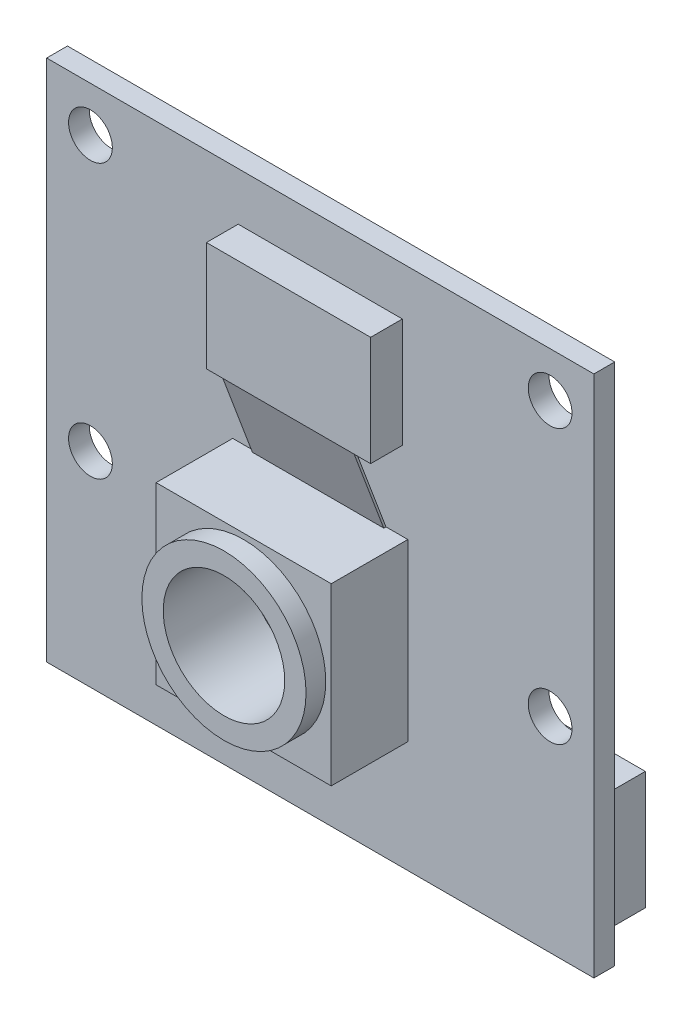
ISO-10303-21;
HEADER;
FILE_DESCRIPTION(('STEP AP214'),'2;1');
FILE_NAME('part.step','',(''),(''),'','','');
FILE_SCHEMA(('AUTOMOTIVE_DESIGN { 1 0 10303 214 1 1 1 1 }'));
ENDSEC;
DATA;
#1=APPLICATION_CONTEXT('core data for automotive mechanical design processes');
#2=APPLICATION_PROTOCOL_DEFINITION('international standard','automotive_design',2000,#1);
#3=PRODUCT_CONTEXT('',#1,'mechanical');
#4=PRODUCT('Part','Part','',(#3));
#5=PRODUCT_RELATED_PRODUCT_CATEGORY('part','',(#4));
#6=PRODUCT_DEFINITION_FORMATION('','',#4);
#7=PRODUCT_DEFINITION_CONTEXT('part definition',#1,'design');
#8=PRODUCT_DEFINITION('design','',#6,#7);
#9=PRODUCT_DEFINITION_SHAPE('','',#8);
#10=(LENGTH_UNIT() NAMED_UNIT(*) SI_UNIT(.MILLI.,.METRE.));
#11=(NAMED_UNIT(*) PLANE_ANGLE_UNIT() SI_UNIT($,.RADIAN.));
#12=(NAMED_UNIT(*) SI_UNIT($,.STERADIAN.) SOLID_ANGLE_UNIT());
#13=UNCERTAINTY_MEASURE_WITH_UNIT(LENGTH_MEASURE(1.E-05),#10,'distance_accuracy_value','');
#14=(GEOMETRIC_REPRESENTATION_CONTEXT(3) GLOBAL_UNCERTAINTY_ASSIGNED_CONTEXT((#13)) GLOBAL_UNIT_ASSIGNED_CONTEXT((#10,
#11,#12)) REPRESENTATION_CONTEXT('',''));
#15=CARTESIAN_POINT('',(0.,0.,0.));
#16=DIRECTION('',(0.,0.,1.));
#17=DIRECTION('',(1.,0.,0.));
#18=AXIS2_PLACEMENT_3D('',#15,#16,#17);
#19=CARTESIAN_POINT('',(0.,0.,0.));
#20=DIRECTION('',(0.,0.,1.));
#21=DIRECTION('',(1.,0.,0.));
#22=AXIS2_PLACEMENT_3D('',#19,#20,#21);
#23=PLANE('',#22);
#24=DIRECTION('',(1.,0.,0.));
#25=VECTOR('',#24,1.);
#26=CARTESIAN_POINT('',(0.,0.,0.));
#27=LINE('',#26,#25);
#28=CARTESIAN_POINT('',(0.,0.,0.));
#29=VERTEX_POINT('',#28);
#30=CARTESIAN_POINT('',(25.,0.,0.));
#31=VERTEX_POINT('',#30);
#32=EDGE_CURVE('E347',#29,#31,#27,.T.);
#33=ORIENTED_EDGE('',*,*,#32,.F.);
#34=DIRECTION('',(0.,1.,0.));
#35=VECTOR('',#34,1.);
#36=CARTESIAN_POINT('',(0.,0.,0.));
#37=LINE('',#36,#35);
#38=CARTESIAN_POINT('',(0.,23.9,0.));
#39=VERTEX_POINT('',#38);
#40=EDGE_CURVE('E315',#29,#39,#37,.T.);
#41=ORIENTED_EDGE('',*,*,#40,.T.);
#42=DIRECTION('',(1.,0.,0.));
#43=VECTOR('',#42,1.);
#44=CARTESIAN_POINT('',(0.,23.9,0.));
#45=LINE('',#44,#43);
#46=CARTESIAN_POINT('',(25.,23.9,0.));
#47=VERTEX_POINT('',#46);
#48=EDGE_CURVE('E353',#39,#47,#45,.T.);
#49=ORIENTED_EDGE('',*,*,#48,.T.);
#50=DIRECTION('',(0.,1.,0.));
#51=VECTOR('',#50,1.);
#52=CARTESIAN_POINT('',(25.,0.,0.));
#53=LINE('',#52,#51);
#54=EDGE_CURVE('E350',#31,#47,#53,.T.);
#55=ORIENTED_EDGE('',*,*,#54,.F.);
#56=EDGE_LOOP('',(#33,#41,#49,#55));
#57=FACE_BOUND('',#56,.T.);
#58=CARTESIAN_POINT('',(2.,21.85,0.));
#59=DIRECTION('',(0.,0.,1.));
#60=DIRECTION('',(1.,0.,0.));
#61=AXIS2_PLACEMENT_3D('',#58,#59,#60);
#62=CIRCLE('',#61,1.);
#63=CARTESIAN_POINT('',(3.,21.85,0.));
#64=VERTEX_POINT('',#63);
#65=EDGE_CURVE('E344',#64,#64,#62,.T.);
#66=ORIENTED_EDGE('',*,*,#65,.T.);
#67=EDGE_LOOP('',(#66));
#68=FACE_BOUND('',#67,.T.);
#69=CARTESIAN_POINT('',(23.,21.85,0.));
#70=DIRECTION('',(0.,0.,1.));
#71=DIRECTION('',(1.,0.,0.));
#72=AXIS2_PLACEMENT_3D('',#69,#70,#71);
#73=CIRCLE('',#72,1.);
#74=CARTESIAN_POINT('',(24.,21.85,0.));
#75=VERTEX_POINT('',#74);
#76=EDGE_CURVE('E341',#75,#75,#73,.T.);
#77=ORIENTED_EDGE('',*,*,#76,.T.);
#78=EDGE_LOOP('',(#77));
#79=FACE_BOUND('',#78,.T.);
#80=CARTESIAN_POINT('',(2.,9.35,0.));
#81=DIRECTION('',(0.,0.,1.));
#82=DIRECTION('',(1.,0.,0.));
#83=AXIS2_PLACEMENT_3D('',#80,#81,#82);
#84=CIRCLE('',#83,1.);
#85=CARTESIAN_POINT('',(3.,9.35,0.));
#86=VERTEX_POINT('',#85);
#87=EDGE_CURVE('E338',#86,#86,#84,.T.);
#88=ORIENTED_EDGE('',*,*,#87,.T.);
#89=EDGE_LOOP('',(#88));
#90=FACE_BOUND('',#89,.T.);
#91=CARTESIAN_POINT('',(23.,9.35,0.));
#92=DIRECTION('',(0.,0.,1.));
#93=DIRECTION('',(1.,0.,0.));
#94=AXIS2_PLACEMENT_3D('',#91,#92,#93);
#95=CIRCLE('',#94,1.);
#96=CARTESIAN_POINT('',(24.,9.35,0.));
#97=VERTEX_POINT('',#96);
#98=EDGE_CURVE('E310',#97,#97,#95,.T.);
#99=ORIENTED_EDGE('',*,*,#98,.T.);
#100=EDGE_LOOP('',(#99));
#101=FACE_BOUND('',#100,.T.);
#102=DIRECTION('',(0.,-1.,0.));
#103=VECTOR('',#102,1.);
#104=CARTESIAN_POINT('',(23.6,0.,0.));
#105=LINE('',#104,#103);
#106=CARTESIAN_POINT('',(23.6,5.59999999999999,0.));
#107=VERTEX_POINT('',#106);
#108=CARTESIAN_POINT('',(23.6,0.2,0.));
#109=VERTEX_POINT('',#108);
#110=EDGE_CURVE('E198',#107,#109,#105,.T.);
#111=ORIENTED_EDGE('',*,*,#110,.F.);
#112=DIRECTION('',(1.,0.,0.));
#113=VECTOR('',#112,1.);
#114=CARTESIAN_POINT('',(0.,5.6,0.));
#115=LINE('',#114,#113);
#116=CARTESIAN_POINT('',(1.4,5.6,0.));
#117=VERTEX_POINT('',#116);
#118=EDGE_CURVE('E195',#117,#107,#115,.T.);
#119=ORIENTED_EDGE('',*,*,#118,.F.);
#120=DIRECTION('',(0.,-1.,0.));
#121=VECTOR('',#120,1.);
#122=CARTESIAN_POINT('',(1.4,0.,0.));
#123=LINE('',#122,#121);
#124=CARTESIAN_POINT('',(1.4,0.2,0.));
#125=VERTEX_POINT('',#124);
#126=EDGE_CURVE('E60',#117,#125,#123,.T.);
#127=ORIENTED_EDGE('',*,*,#126,.T.);
#128=DIRECTION('',(-1.,0.,0.));
#129=VECTOR('',#128,1.);
#130=CARTESIAN_POINT('',(0.,0.2,0.));
#131=LINE('',#130,#129);
#132=EDGE_CURVE('E55',#109,#125,#131,.T.);
#133=ORIENTED_EDGE('',*,*,#132,.F.);
#134=EDGE_LOOP('',(#111,#119,#127,#133));
#135=FACE_BOUND('',#134,.T.);
#136=ADVANCED_FACE('F40',(#57,#68,#79,#90,#101,#135),#23,.F.);
#137=CARTESIAN_POINT('',(8.50000000000001,13.1,5.35));
#138=DIRECTION('',(1.,0.,0.));
#139=DIRECTION('',(0.,1.,0.));
#140=AXIS2_PLACEMENT_3D('',#137,#138,#139);
#141=PLANE('',#140);
#142=DIRECTION('',(0.,-1.,0.));
#143=VECTOR('',#142,1.);
#144=CARTESIAN_POINT('',(8.50000000000001,0.,4.45));
#145=LINE('',#144,#143);
#146=CARTESIAN_POINT('',(8.50000000000001,13.1,4.45));
#147=VERTEX_POINT('',#146);
#148=CARTESIAN_POINT('',(8.50000000000001,5.1,4.45));
#149=VERTEX_POINT('',#148);
#150=EDGE_CURVE('E249',#147,#149,#145,.T.);
#151=ORIENTED_EDGE('',*,*,#150,.F.);
#152=DIRECTION('',(0.,0.,-1.));
#153=VECTOR('',#152,1.);
#154=CARTESIAN_POINT('',(8.50000000000001,13.1,5.35));
#155=LINE('',#154,#153);
#156=CARTESIAN_POINT('',(8.50000000000001,13.1,0.95));
#157=VERTEX_POINT('',#156);
#158=EDGE_CURVE('E270',#147,#157,#155,.T.);
#159=ORIENTED_EDGE('',*,*,#158,.T.);
#160=DIRECTION('',(0.,-1.,0.));
#161=VECTOR('',#160,1.);
#162=CARTESIAN_POINT('',(8.50000000000001,13.1,0.95));
#163=LINE('',#162,#161);
#164=CARTESIAN_POINT('',(8.50000000000001,5.1,0.95));
#165=VERTEX_POINT('',#164);
#166=EDGE_CURVE('E255',#157,#165,#163,.T.);
#167=ORIENTED_EDGE('',*,*,#166,.T.);
#168=DIRECTION('',(0.,0.,-1.));
#169=VECTOR('',#168,1.);
#170=CARTESIAN_POINT('',(8.50000000000001,5.1,5.35));
#171=LINE('',#170,#169);
#172=EDGE_CURVE('E277',#149,#165,#171,.T.);
#173=ORIENTED_EDGE('',*,*,#172,.F.);
#174=EDGE_LOOP('',(#151,#159,#167,#173));
#175=FACE_BOUND('',#174,.T.);
#176=ADVANCED_FACE('F393',(#175),#141,.F.);
#177=CARTESIAN_POINT('',(8.50000000000001,5.1,5.35));
#178=DIRECTION('',(0.,1.,0.));
#179=DIRECTION('',(-1.,0.,0.));
#180=AXIS2_PLACEMENT_3D('',#177,#178,#179);
#181=PLANE('',#180);
#182=DIRECTION('',(1.,0.,0.));
#183=VECTOR('',#182,1.);
#184=CARTESIAN_POINT('',(0.,5.1,4.45));
#185=LINE('',#184,#183);
#186=CARTESIAN_POINT('',(16.5,5.1,4.45));
#187=VERTEX_POINT('',#186);
#188=EDGE_CURVE('E251',#149,#187,#185,.T.);
#189=ORIENTED_EDGE('',*,*,#188,.F.);
#190=ORIENTED_EDGE('',*,*,#172,.T.);
#191=DIRECTION('',(1.,0.,0.));
#192=VECTOR('',#191,1.);
#193=CARTESIAN_POINT('',(8.50000000000001,5.1,0.95));
#194=LINE('',#193,#192);
#195=CARTESIAN_POINT('',(16.5,5.1,0.95));
#196=VERTEX_POINT('',#195);
#197=EDGE_CURVE('E260',#165,#196,#194,.T.);
#198=ORIENTED_EDGE('',*,*,#197,.T.);
#199=DIRECTION('',(0.,0.,-1.));
#200=VECTOR('',#199,1.);
#201=CARTESIAN_POINT('',(16.5,5.1,5.35));
#202=LINE('',#201,#200);
#203=EDGE_CURVE('E275',#187,#196,#202,.T.);
#204=ORIENTED_EDGE('',*,*,#203,.F.);
#205=EDGE_LOOP('',(#189,#190,#198,#204));
#206=FACE_BOUND('',#205,.T.);
#207=ADVANCED_FACE('F398',(#206),#181,.F.);
#208=CARTESIAN_POINT('',(16.5,13.1,5.35));
#209=DIRECTION('',(-1.,0.,0.));
#210=DIRECTION('',(0.,-1.,0.));
#211=AXIS2_PLACEMENT_3D('',#208,#209,#210);
#212=PLANE('',#211);
#213=DIRECTION('',(0.,1.,0.));
#214=VECTOR('',#213,1.);
#215=CARTESIAN_POINT('',(16.5,0.,4.45));
#216=LINE('',#215,#214);
#217=CARTESIAN_POINT('',(16.5,13.1,4.45));
#218=VERTEX_POINT('',#217);
#219=EDGE_CURVE('E253',#187,#218,#216,.T.);
#220=ORIENTED_EDGE('',*,*,#219,.F.);
#221=ORIENTED_EDGE('',*,*,#203,.T.);
#222=DIRECTION('',(0.,1.,0.));
#223=VECTOR('',#222,1.);
#224=CARTESIAN_POINT('',(16.5,13.1,0.95));
#225=LINE('',#224,#223);
#226=CARTESIAN_POINT('',(16.5,13.1,0.95));
#227=VERTEX_POINT('',#226);
#228=EDGE_CURVE('E263',#196,#227,#225,.T.);
#229=ORIENTED_EDGE('',*,*,#228,.T.);
#230=DIRECTION('',(0.,0.,-1.));
#231=VECTOR('',#230,1.);
#232=CARTESIAN_POINT('',(16.5,13.1,5.35));
#233=LINE('',#232,#231);
#234=EDGE_CURVE('E273',#218,#227,#233,.T.);
#235=ORIENTED_EDGE('',*,*,#234,.F.);
#236=EDGE_LOOP('',(#220,#221,#229,#235));
#237=FACE_BOUND('',#236,.T.);
#238=ADVANCED_FACE('F497',(#237),#212,.F.);
#239=CARTESIAN_POINT('',(8.50000000000001,13.1,5.35));
#240=DIRECTION('',(0.,-1.,0.));
#241=DIRECTION('',(0.,0.,-1.));
#242=AXIS2_PLACEMENT_3D('',#239,#240,#241);
#243=PLANE('',#242);
#244=DIRECTION('',(1.,0.,0.));
#245=VECTOR('',#244,1.);
#246=CARTESIAN_POINT('',(5.61895632593499,13.1,1.05));
#247=LINE('',#246,#245);
#248=CARTESIAN_POINT('',(9.5,13.1,1.05));
#249=VERTEX_POINT('',#248);
#250=CARTESIAN_POINT('',(15.5,13.1,1.05));
#251=VERTEX_POINT('',#250);
#252=EDGE_CURVE('E222',#249,#251,#247,.T.);
#253=ORIENTED_EDGE('',*,*,#252,.F.);
#254=DIRECTION('',(0.,0.,-1.));
#255=VECTOR('',#254,1.);
#256=CARTESIAN_POINT('',(9.5,13.1,0.95));
#257=LINE('',#256,#255);
#258=CARTESIAN_POINT('',(9.5,13.1,0.95));
#259=VERTEX_POINT('',#258);
#260=EDGE_CURVE('E210',#249,#259,#257,.T.);
#261=ORIENTED_EDGE('',*,*,#260,.T.);
#262=DIRECTION('',(-1.,0.,0.));
#263=VECTOR('',#262,1.);
#264=CARTESIAN_POINT('',(8.50000000000001,13.1,0.95));
#265=LINE('',#264,#263);
#266=EDGE_CURVE('E266',#259,#157,#265,.T.);
#267=ORIENTED_EDGE('',*,*,#266,.T.);
#268=ORIENTED_EDGE('',*,*,#158,.F.);
#269=DIRECTION('',(-1.,0.,0.));
#270=VECTOR('',#269,1.);
#271=CARTESIAN_POINT('',(0.,13.1,4.45));
#272=LINE('',#271,#270);
#273=EDGE_CURVE('E247',#218,#147,#272,.T.);
#274=ORIENTED_EDGE('',*,*,#273,.F.);
#275=ORIENTED_EDGE('',*,*,#234,.T.);
#276=CARTESIAN_POINT('',(15.5,13.1,0.95));
#277=VERTEX_POINT('',#276);
#278=EDGE_CURVE('E267',#227,#277,#265,.T.);
#279=ORIENTED_EDGE('',*,*,#278,.T.);
#280=DIRECTION('',(0.,0.,-1.));
#281=VECTOR('',#280,1.);
#282=CARTESIAN_POINT('',(15.5,13.1,0.95));
#283=LINE('',#282,#281);
#284=EDGE_CURVE('E202',#251,#277,#283,.T.);
#285=ORIENTED_EDGE('',*,*,#284,.F.);
#286=EDGE_LOOP('',(#253,#261,#267,#268,#274,#275,#279,#285));
#287=FACE_BOUND('',#286,.T.);
#288=ADVANCED_FACE('F388',(#287),#243,.F.);
#289=CARTESIAN_POINT('',(0.,0.,0.95));
#290=DIRECTION('',(0.,0.,1.));
#291=DIRECTION('',(1.,0.,0.));
#292=AXIS2_PLACEMENT_3D('',#289,#290,#291);
#293=PLANE('',#292);
#294=DIRECTION('',(1.,0.,0.));
#295=VECTOR('',#294,1.);
#296=CARTESIAN_POINT('',(8.75,16.7,0.95));
#297=LINE('',#296,#295);
#298=CARTESIAN_POINT('',(8.75,16.7,0.95));
#299=VERTEX_POINT('',#298);
#300=CARTESIAN_POINT('',(16.25,16.7,0.95));
#301=VERTEX_POINT('',#300);
#302=EDGE_CURVE('E295',#299,#301,#297,.T.);
#303=ORIENTED_EDGE('',*,*,#302,.F.);
#304=DIRECTION('',(0.,-1.,0.));
#305=VECTOR('',#304,1.);
#306=CARTESIAN_POINT('',(8.75,21.7,0.95));
#307=LINE('',#306,#305);
#308=CARTESIAN_POINT('',(8.75,21.7,0.95));
#309=VERTEX_POINT('',#308);
#310=EDGE_CURVE('E279',#309,#299,#307,.T.);
#311=ORIENTED_EDGE('',*,*,#310,.F.);
#312=DIRECTION('',(-1.,0.,0.));
#313=VECTOR('',#312,1.);
#314=CARTESIAN_POINT('',(8.75,21.7,0.95));
#315=LINE('',#314,#313);
#316=CARTESIAN_POINT('',(16.25,21.7,0.95));
#317=VERTEX_POINT('',#316);
#318=EDGE_CURVE('E284',#317,#309,#315,.T.);
#319=ORIENTED_EDGE('',*,*,#318,.F.);
#320=DIRECTION('',(0.,1.,0.));
#321=VECTOR('',#320,1.);
#322=CARTESIAN_POINT('',(16.25,21.7,0.95));
#323=LINE('',#322,#321);
#324=EDGE_CURVE('E297',#301,#317,#323,.T.);
#325=ORIENTED_EDGE('',*,*,#324,.F.);
#326=EDGE_LOOP('',(#303,#311,#319,#325));
#327=FACE_BOUND('',#326,.T.);
#328=CARTESIAN_POINT('',(23.,9.35,0.95));
#329=DIRECTION('',(0.,0.,1.));
#330=DIRECTION('',(1.,0.,0.));
#331=AXIS2_PLACEMENT_3D('',#328,#329,#330);
#332=CIRCLE('',#331,1.);
#333=CARTESIAN_POINT('',(24.,9.35,0.95));
#334=VERTEX_POINT('',#333);
#335=EDGE_CURVE('E311',#334,#334,#332,.T.);
#336=ORIENTED_EDGE('',*,*,#335,.F.);
#337=EDGE_LOOP('',(#336));
#338=FACE_BOUND('',#337,.T.);
#339=CARTESIAN_POINT('',(2.,9.35,0.95));
#340=DIRECTION('',(0.,0.,1.));
#341=DIRECTION('',(1.,0.,0.));
#342=AXIS2_PLACEMENT_3D('',#339,#340,#341);
#343=CIRCLE('',#342,1.);
#344=CARTESIAN_POINT('',(3.,9.35,0.95));
#345=VERTEX_POINT('',#344);
#346=EDGE_CURVE('E314',#345,#345,#343,.T.);
#347=ORIENTED_EDGE('',*,*,#346,.F.);
#348=EDGE_LOOP('',(#347));
#349=FACE_BOUND('',#348,.T.);
#350=CARTESIAN_POINT('',(23.,21.85,0.95));
#351=DIRECTION('',(0.,0.,1.));
#352=DIRECTION('',(1.,0.,0.));
#353=AXIS2_PLACEMENT_3D('',#350,#351,#352);
#354=CIRCLE('',#353,1.);
#355=CARTESIAN_POINT('',(24.,21.85,0.95));
#356=VERTEX_POINT('',#355);
#357=EDGE_CURVE('E318',#356,#356,#354,.T.);
#358=ORIENTED_EDGE('',*,*,#357,.F.);
#359=EDGE_LOOP('',(#358));
#360=FACE_BOUND('',#359,.T.);
#361=CARTESIAN_POINT('',(2.,21.85,0.95));
#362=DIRECTION('',(0.,0.,1.));
#363=DIRECTION('',(1.,0.,0.));
#364=AXIS2_PLACEMENT_3D('',#361,#362,#363);
#365=CIRCLE('',#364,1.);
#366=CARTESIAN_POINT('',(3.,21.85,0.95));
#367=VERTEX_POINT('',#366);
#368=EDGE_CURVE('E321',#367,#367,#365,.T.);
#369=ORIENTED_EDGE('',*,*,#368,.F.);
#370=EDGE_LOOP('',(#369));
#371=FACE_BOUND('',#370,.T.);
#372=DIRECTION('',(1.,0.,0.));
#373=VECTOR('',#372,1.);
#374=CARTESIAN_POINT('',(0.,0.,0.95));
#375=LINE('',#374,#373);
#376=CARTESIAN_POINT('',(0.,0.,0.95));
#377=VERTEX_POINT('',#376);
#378=CARTESIAN_POINT('',(25.,0.,0.95));
#379=VERTEX_POINT('',#378);
#380=EDGE_CURVE('E324',#377,#379,#375,.T.);
#381=ORIENTED_EDGE('',*,*,#380,.T.);
#382=DIRECTION('',(0.,1.,0.));
#383=VECTOR('',#382,1.);
#384=CARTESIAN_POINT('',(25.,0.,0.95));
#385=LINE('',#384,#383);
#386=CARTESIAN_POINT('',(25.,23.9,0.95));
#387=VERTEX_POINT('',#386);
#388=EDGE_CURVE('E327',#379,#387,#385,.T.);
#389=ORIENTED_EDGE('',*,*,#388,.T.);
#390=DIRECTION('',(1.,0.,0.));
#391=VECTOR('',#390,1.);
#392=CARTESIAN_POINT('',(0.,23.9,0.95));
#393=LINE('',#392,#391);
#394=CARTESIAN_POINT('',(0.,23.9,0.95));
#395=VERTEX_POINT('',#394);
#396=EDGE_CURVE('E329',#395,#387,#393,.T.);
#397=ORIENTED_EDGE('',*,*,#396,.F.);
#398=DIRECTION('',(0.,1.,0.));
#399=VECTOR('',#398,1.);
#400=CARTESIAN_POINT('',(0.,0.,0.95));
#401=LINE('',#400,#399);
#402=EDGE_CURVE('E332',#377,#395,#401,.T.);
#403=ORIENTED_EDGE('',*,*,#402,.F.);
#404=EDGE_LOOP('',(#381,#389,#397,#403));
#405=FACE_BOUND('',#404,.T.);
#406=ORIENTED_EDGE('',*,*,#197,.F.);
#407=ORIENTED_EDGE('',*,*,#166,.F.);
#408=ORIENTED_EDGE('',*,*,#266,.F.);
#409=DIRECTION('',(1.,0.,0.));
#410=VECTOR('',#409,1.);
#411=CARTESIAN_POINT('',(5.61895632593499,13.1,0.95));
#412=LINE('',#411,#410);
#413=EDGE_CURVE('E218',#259,#277,#412,.T.);
#414=ORIENTED_EDGE('',*,*,#413,.T.);
#415=ORIENTED_EDGE('',*,*,#278,.F.);
#416=ORIENTED_EDGE('',*,*,#228,.F.);
#417=EDGE_LOOP('',(#406,#407,#408,#414,#415,#416));
#418=FACE_BOUND('',#417,.T.);
#419=ADVANCED_FACE('F377',(#327,#338,#349,#360,#371,#405,#418),#293,.T.);
#420=CARTESIAN_POINT('',(0.,0.,0.95));
#421=DIRECTION('',(0.,1.,0.));
#422=DIRECTION('',(0.,0.,1.));
#423=AXIS2_PLACEMENT_3D('',#420,#421,#422);
#424=PLANE('',#423);
#425=ORIENTED_EDGE('',*,*,#32,.T.);
#426=DIRECTION('',(0.,0.,-1.));
#427=VECTOR('',#426,1.);
#428=CARTESIAN_POINT('',(25.,0.,0.95));
#429=LINE('',#428,#427);
#430=EDGE_CURVE('E11',#379,#31,#429,.T.);
#431=ORIENTED_EDGE('',*,*,#430,.F.);
#432=ORIENTED_EDGE('',*,*,#380,.F.);
#433=DIRECTION('',(0.,0.,-1.));
#434=VECTOR('',#433,1.);
#435=CARTESIAN_POINT('',(0.,0.,0.95));
#436=LINE('',#435,#434);
#437=EDGE_CURVE('E335',#377,#29,#436,.T.);
#438=ORIENTED_EDGE('',*,*,#437,.T.);
#439=EDGE_LOOP('',(#425,#431,#432,#438));
#440=FACE_BOUND('',#439,.T.);
#441=ADVANCED_FACE('F380',(#440),#424,.F.);
#442=CARTESIAN_POINT('',(25.,0.,0.95));
#443=DIRECTION('',(-1.,0.,0.));
#444=DIRECTION('',(0.,-1.,0.));
#445=AXIS2_PLACEMENT_3D('',#442,#443,#444);
#446=PLANE('',#445);
#447=ORIENTED_EDGE('',*,*,#54,.T.);
#448=DIRECTION('',(0.,0.,-1.));
#449=VECTOR('',#448,1.);
#450=CARTESIAN_POINT('',(25.,23.9,0.95));
#451=LINE('',#450,#449);
#452=EDGE_CURVE('E48',#387,#47,#451,.T.);
#453=ORIENTED_EDGE('',*,*,#452,.F.);
#454=ORIENTED_EDGE('',*,*,#388,.F.);
#455=ORIENTED_EDGE('',*,*,#430,.T.);
#456=EDGE_LOOP('',(#447,#453,#454,#455));
#457=FACE_BOUND('',#456,.T.);
#458=ADVANCED_FACE('F366',(#457),#446,.F.);
#459=CARTESIAN_POINT('',(0.,23.9,0.95));
#460=DIRECTION('',(0.,1.,0.));
#461=DIRECTION('',(0.,0.,1.));
#462=AXIS2_PLACEMENT_3D('',#459,#460,#461);
#463=PLANE('',#462);
#464=ORIENTED_EDGE('',*,*,#48,.F.);
#465=DIRECTION('',(0.,0.,-1.));
#466=VECTOR('',#465,1.);
#467=CARTESIAN_POINT('',(0.,23.9,0.95));
#468=LINE('',#467,#466);
#469=EDGE_CURVE('E359',#395,#39,#468,.T.);
#470=ORIENTED_EDGE('',*,*,#469,.F.);
#471=ORIENTED_EDGE('',*,*,#396,.T.);
#472=ORIENTED_EDGE('',*,*,#452,.T.);
#473=EDGE_LOOP('',(#464,#470,#471,#472));
#474=FACE_BOUND('',#473,.T.);
#475=ADVANCED_FACE('F363',(#474),#463,.T.);
#476=CARTESIAN_POINT('',(2.,21.85,0.95));
#477=DIRECTION('',(0.,0.,-1.));
#478=DIRECTION('',(-1.,0.,0.));
#479=AXIS2_PLACEMENT_3D('',#476,#477,#478);
#480=CYLINDRICAL_SURFACE('',#479,1.);
#481=ORIENTED_EDGE('',*,*,#368,.T.);
#482=EDGE_LOOP('',(#481));
#483=FACE_BOUND('',#482,.T.);
#484=ORIENTED_EDGE('',*,*,#65,.F.);
#485=EDGE_LOOP('',(#484));
#486=FACE_BOUND('',#485,.T.);
#487=ADVANCED_FACE('F407',(#483,#486),#480,.F.);
#488=CARTESIAN_POINT('',(23.,21.85,0.95));
#489=DIRECTION('',(0.,0.,-1.));
#490=DIRECTION('',(-1.,0.,0.));
#491=AXIS2_PLACEMENT_3D('',#488,#489,#490);
#492=CYLINDRICAL_SURFACE('',#491,1.);
#493=ORIENTED_EDGE('',*,*,#357,.T.);
#494=EDGE_LOOP('',(#493));
#495=FACE_BOUND('',#494,.T.);
#496=ORIENTED_EDGE('',*,*,#76,.F.);
#497=EDGE_LOOP('',(#496));
#498=FACE_BOUND('',#497,.T.);
#499=ADVANCED_FACE('F411',(#495,#498),#492,.F.);
#500=CARTESIAN_POINT('',(2.,9.35,0.95));
#501=DIRECTION('',(0.,0.,-1.));
#502=DIRECTION('',(-1.,0.,0.));
#503=AXIS2_PLACEMENT_3D('',#500,#501,#502);
#504=CYLINDRICAL_SURFACE('',#503,1.);
#505=ORIENTED_EDGE('',*,*,#346,.T.);
#506=EDGE_LOOP('',(#505));
#507=FACE_BOUND('',#506,.T.);
#508=ORIENTED_EDGE('',*,*,#87,.F.);
#509=EDGE_LOOP('',(#508));
#510=FACE_BOUND('',#509,.T.);
#511=ADVANCED_FACE('F416',(#507,#510),#504,.F.);
#512=CARTESIAN_POINT('',(23.,9.35,0.95));
#513=DIRECTION('',(0.,0.,-1.));
#514=DIRECTION('',(-1.,0.,0.));
#515=AXIS2_PLACEMENT_3D('',#512,#513,#514);
#516=CYLINDRICAL_SURFACE('',#515,1.);
#517=ORIENTED_EDGE('',*,*,#335,.T.);
#518=EDGE_LOOP('',(#517));
#519=FACE_BOUND('',#518,.T.);
#520=ORIENTED_EDGE('',*,*,#98,.F.);
#521=EDGE_LOOP('',(#520));
#522=FACE_BOUND('',#521,.T.);
#523=ADVANCED_FACE('F42',(#519,#522),#516,.F.);
#524=CARTESIAN_POINT('',(0.,0.,0.95));
#525=DIRECTION('',(-1.,0.,0.));
#526=DIRECTION('',(0.,-1.,0.));
#527=AXIS2_PLACEMENT_3D('',#524,#525,#526);
#528=PLANE('',#527);
#529=ORIENTED_EDGE('',*,*,#40,.F.);
#530=ORIENTED_EDGE('',*,*,#437,.F.);
#531=ORIENTED_EDGE('',*,*,#402,.T.);
#532=ORIENTED_EDGE('',*,*,#469,.T.);
#533=EDGE_LOOP('',(#529,#530,#531,#532));
#534=FACE_BOUND('',#533,.T.);
#535=ADVANCED_FACE('F373',(#534),#528,.T.);
#536=CARTESIAN_POINT('',(8.75,21.7,2.4));
#537=DIRECTION('',(1.,0.,0.));
#538=DIRECTION('',(0.,0.,-1.));
#539=AXIS2_PLACEMENT_3D('',#536,#537,#538);
#540=PLANE('',#539);
#541=ORIENTED_EDGE('',*,*,#310,.T.);
#542=DIRECTION('',(0.,0.,-1.));
#543=VECTOR('',#542,1.);
#544=CARTESIAN_POINT('',(8.75,16.7,2.4));
#545=LINE('',#544,#543);
#546=CARTESIAN_POINT('',(8.75,16.7,2.4));
#547=VERTEX_POINT('',#546);
#548=EDGE_CURVE('E308',#547,#299,#545,.T.);
#549=ORIENTED_EDGE('',*,*,#548,.F.);
#550=DIRECTION('',(0.,-1.,0.));
#551=VECTOR('',#550,1.);
#552=CARTESIAN_POINT('',(8.75,21.7,2.4));
#553=LINE('',#552,#551);
#554=CARTESIAN_POINT('',(8.75,21.7,2.4));
#555=VERTEX_POINT('',#554);
#556=EDGE_CURVE('E280',#555,#547,#553,.T.);
#557=ORIENTED_EDGE('',*,*,#556,.F.);
#558=DIRECTION('',(0.,0.,-1.));
#559=VECTOR('',#558,1.);
#560=CARTESIAN_POINT('',(8.75,21.7,2.4));
#561=LINE('',#560,#559);
#562=EDGE_CURVE('E292',#555,#309,#561,.T.);
#563=ORIENTED_EDGE('',*,*,#562,.T.);
#564=EDGE_LOOP('',(#541,#549,#557,#563));
#565=FACE_BOUND('',#564,.T.);
#566=ADVANCED_FACE('F405',(#565),#540,.F.);
#567=CARTESIAN_POINT('',(8.75,16.7,2.4));
#568=DIRECTION('',(0.,1.,0.));
#569=DIRECTION('',(0.,0.,1.));
#570=AXIS2_PLACEMENT_3D('',#567,#568,#569);
#571=PLANE('',#570);
#572=DIRECTION('',(1.,0.,0.));
#573=VECTOR('',#572,1.);
#574=CARTESIAN_POINT('',(5.61895632593499,16.7,2.3));
#575=LINE('',#574,#573);
#576=CARTESIAN_POINT('',(9.5,16.7,2.3));
#577=VERTEX_POINT('',#576);
#578=CARTESIAN_POINT('',(15.5,16.7,2.3));
#579=VERTEX_POINT('',#578);
#580=EDGE_CURVE('E227',#577,#579,#575,.T.);
#581=ORIENTED_EDGE('',*,*,#580,.F.);
#582=DIRECTION('',(0.,0.,1.));
#583=VECTOR('',#582,1.);
#584=CARTESIAN_POINT('',(9.5,16.7,2.4));
#585=LINE('',#584,#583);
#586=CARTESIAN_POINT('',(9.5,16.7,2.4));
#587=VERTEX_POINT('',#586);
#588=EDGE_CURVE('E224',#577,#587,#585,.T.);
#589=ORIENTED_EDGE('',*,*,#588,.T.);
#590=DIRECTION('',(1.,0.,0.));
#591=VECTOR('',#590,1.);
#592=CARTESIAN_POINT('',(8.75,16.7,2.4));
#593=LINE('',#592,#591);
#594=EDGE_CURVE('E285',#547,#587,#593,.T.);
#595=ORIENTED_EDGE('',*,*,#594,.F.);
#596=ORIENTED_EDGE('',*,*,#548,.T.);
#597=ORIENTED_EDGE('',*,*,#302,.T.);
#598=DIRECTION('',(0.,0.,-1.));
#599=VECTOR('',#598,1.);
#600=CARTESIAN_POINT('',(16.25,16.7,2.4));
#601=LINE('',#600,#599);
#602=CARTESIAN_POINT('',(16.25,16.7,2.4));
#603=VERTEX_POINT('',#602);
#604=EDGE_CURVE('E305',#603,#301,#601,.T.);
#605=ORIENTED_EDGE('',*,*,#604,.F.);
#606=CARTESIAN_POINT('',(15.5,16.7,2.4));
#607=VERTEX_POINT('',#606);
#608=EDGE_CURVE('E283',#607,#603,#593,.T.);
#609=ORIENTED_EDGE('',*,*,#608,.F.);
#610=DIRECTION('',(0.,0.,1.));
#611=VECTOR('',#610,1.);
#612=CARTESIAN_POINT('',(15.5,16.7,2.4));
#613=LINE('',#612,#611);
#614=EDGE_CURVE('E208',#579,#607,#613,.T.);
#615=ORIENTED_EDGE('',*,*,#614,.F.);
#616=EDGE_LOOP('',(#581,#589,#595,#596,#597,#605,#609,#615));
#617=FACE_BOUND('',#616,.T.);
#618=ADVANCED_FACE('F515',(#617),#571,.F.);
#619=CARTESIAN_POINT('',(16.25,21.7,2.4));
#620=DIRECTION('',(-1.,0.,0.));
#621=DIRECTION('',(0.,-1.,0.));
#622=AXIS2_PLACEMENT_3D('',#619,#620,#621);
#623=PLANE('',#622);
#624=ORIENTED_EDGE('',*,*,#324,.T.);
#625=DIRECTION('',(0.,0.,-1.));
#626=VECTOR('',#625,1.);
#627=CARTESIAN_POINT('',(16.25,21.7,2.4));
#628=LINE('',#627,#626);
#629=CARTESIAN_POINT('',(16.25,21.7,2.4));
#630=VERTEX_POINT('',#629);
#631=EDGE_CURVE('E303',#630,#317,#628,.T.);
#632=ORIENTED_EDGE('',*,*,#631,.F.);
#633=DIRECTION('',(0.,1.,0.));
#634=VECTOR('',#633,1.);
#635=CARTESIAN_POINT('',(16.25,21.7,2.4));
#636=LINE('',#635,#634);
#637=EDGE_CURVE('E288',#603,#630,#636,.T.);
#638=ORIENTED_EDGE('',*,*,#637,.F.);
#639=ORIENTED_EDGE('',*,*,#604,.T.);
#640=EDGE_LOOP('',(#624,#632,#638,#639));
#641=FACE_BOUND('',#640,.T.);
#642=ADVANCED_FACE('F511',(#641),#623,.F.);
#643=CARTESIAN_POINT('',(8.75,21.7,2.4));
#644=DIRECTION('',(0.,-1.,0.));
#645=DIRECTION('',(1.,0.,0.));
#646=AXIS2_PLACEMENT_3D('',#643,#644,#645);
#647=PLANE('',#646);
#648=ORIENTED_EDGE('',*,*,#318,.T.);
#649=ORIENTED_EDGE('',*,*,#562,.F.);
#650=DIRECTION('',(-1.,0.,0.));
#651=VECTOR('',#650,1.);
#652=CARTESIAN_POINT('',(8.75,21.7,2.4));
#653=LINE('',#652,#651);
#654=EDGE_CURVE('E290',#630,#555,#653,.T.);
#655=ORIENTED_EDGE('',*,*,#654,.F.);
#656=ORIENTED_EDGE('',*,*,#631,.T.);
#657=EDGE_LOOP('',(#648,#649,#655,#656));
#658=FACE_BOUND('',#657,.T.);
#659=ADVANCED_FACE('F507',(#658),#647,.F.);
#660=CARTESIAN_POINT('',(0.,0.,2.4));
#661=DIRECTION('',(0.,0.,1.));
#662=DIRECTION('',(1.,0.,0.));
#663=AXIS2_PLACEMENT_3D('',#660,#661,#662);
#664=PLANE('',#663);
#665=ORIENTED_EDGE('',*,*,#556,.T.);
#666=ORIENTED_EDGE('',*,*,#594,.T.);
#667=DIRECTION('',(1.,0.,0.));
#668=VECTOR('',#667,1.);
#669=CARTESIAN_POINT('',(5.61895632593499,16.7,2.4));
#670=LINE('',#669,#668);
#671=EDGE_CURVE('E223',#587,#607,#670,.T.);
#672=ORIENTED_EDGE('',*,*,#671,.T.);
#673=ORIENTED_EDGE('',*,*,#608,.T.);
#674=ORIENTED_EDGE('',*,*,#637,.T.);
#675=ORIENTED_EDGE('',*,*,#654,.T.);
#676=EDGE_LOOP('',(#665,#666,#672,#673,#674,#675));
#677=FACE_BOUND('',#676,.T.);
#678=ADVANCED_FACE('F490',(#677),#664,.T.);
#679=CARTESIAN_POINT('',(12.5,9.1,4.45));
#680=DIRECTION('',(0.,0.,1.));
#681=DIRECTION('',(1.,0.,0.));
#682=AXIS2_PLACEMENT_3D('',#679,#680,#681);
#683=CYLINDRICAL_SURFACE('',#682,3.75);
#684=CARTESIAN_POINT('',(12.5,9.1,4.45));
#685=DIRECTION('',(0.,0.,1.));
#686=DIRECTION('',(1.,0.,0.));
#687=AXIS2_PLACEMENT_3D('',#684,#685,#686);
#688=CIRCLE('',#687,3.75);
#689=CARTESIAN_POINT('',(16.25,9.1,4.45));
#690=VERTEX_POINT('',#689);
#691=EDGE_CURVE('E244',#690,#690,#688,.T.);
#692=ORIENTED_EDGE('',*,*,#691,.T.);
#693=EDGE_LOOP('',(#692));
#694=FACE_BOUND('',#693,.T.);
#695=CARTESIAN_POINT('',(12.5,9.1,5.35));
#696=DIRECTION('',(0.,0.,1.));
#697=DIRECTION('',(1.,0.,0.));
#698=AXIS2_PLACEMENT_3D('',#695,#696,#697);
#699=CIRCLE('',#698,3.75);
#700=CARTESIAN_POINT('',(16.25,9.1,5.35));
#701=VERTEX_POINT('',#700);
#702=EDGE_CURVE('E241',#701,#701,#699,.T.);
#703=ORIENTED_EDGE('',*,*,#702,.F.);
#704=EDGE_LOOP('',(#703));
#705=FACE_BOUND('',#704,.T.);
#706=ADVANCED_FACE('F486',(#694,#705),#683,.T.);
#707=CARTESIAN_POINT('',(0.,0.,4.45));
#708=DIRECTION('',(0.,0.,1.));
#709=DIRECTION('',(1.,0.,0.));
#710=AXIS2_PLACEMENT_3D('',#707,#708,#709);
#711=PLANE('',#710);
#712=ORIENTED_EDGE('',*,*,#691,.F.);
#713=EDGE_LOOP('',(#712));
#714=FACE_BOUND('',#713,.T.);
#715=ORIENTED_EDGE('',*,*,#273,.T.);
#716=ORIENTED_EDGE('',*,*,#150,.T.);
#717=ORIENTED_EDGE('',*,*,#188,.T.);
#718=ORIENTED_EDGE('',*,*,#219,.T.);
#719=EDGE_LOOP('',(#715,#716,#717,#718));
#720=FACE_BOUND('',#719,.T.);
#721=ADVANCED_FACE('F483',(#714,#720),#711,.T.);
#722=CARTESIAN_POINT('',(0.,0.,5.35));
#723=DIRECTION('',(0.,0.,1.));
#724=DIRECTION('',(1.,0.,0.));
#725=AXIS2_PLACEMENT_3D('',#722,#723,#724);
#726=PLANE('',#725);
#727=CARTESIAN_POINT('',(12.5,9.1,5.35));
#728=DIRECTION('',(0.,0.,1.));
#729=DIRECTION('',(1.,0.,0.));
#730=AXIS2_PLACEMENT_3D('',#727,#728,#729);
#731=CIRCLE('',#730,2.775);
#732=CARTESIAN_POINT('',(15.275,9.1,5.35));
#733=VERTEX_POINT('',#732);
#734=EDGE_CURVE('E237',#733,#733,#731,.T.);
#735=ORIENTED_EDGE('',*,*,#734,.F.);
#736=EDGE_LOOP('',(#735));
#737=FACE_BOUND('',#736,.T.);
#738=ORIENTED_EDGE('',*,*,#702,.T.);
#739=EDGE_LOOP('',(#738));
#740=FACE_BOUND('',#739,.T.);
#741=ADVANCED_FACE('F481',(#737,#740),#726,.T.);
#742=CARTESIAN_POINT('',(12.5,9.1,1.45));
#743=DIRECTION('',(0.,0.,1.));
#744=DIRECTION('',(1.,0.,0.));
#745=AXIS2_PLACEMENT_3D('',#742,#743,#744);
#746=CYLINDRICAL_SURFACE('',#745,2.775);
#747=CARTESIAN_POINT('',(12.5,9.1,1.45));
#748=DIRECTION('',(0.,0.,1.));
#749=DIRECTION('',(1.,0.,0.));
#750=AXIS2_PLACEMENT_3D('',#747,#748,#749);
#751=CIRCLE('',#750,2.775);
#752=CARTESIAN_POINT('',(15.275,9.1,1.45));
#753=VERTEX_POINT('',#752);
#754=EDGE_CURVE('E238',#753,#753,#751,.T.);
#755=ORIENTED_EDGE('',*,*,#754,.F.);
#756=EDGE_LOOP('',(#755));
#757=FACE_BOUND('',#756,.T.);
#758=ORIENTED_EDGE('',*,*,#734,.T.);
#759=EDGE_LOOP('',(#758));
#760=FACE_BOUND('',#759,.T.);
#761=ADVANCED_FACE('F477',(#757,#760),#746,.F.);
#762=CARTESIAN_POINT('',(12.5,9.1,1.45));
#763=DIRECTION('',(0.,0.,1.));
#764=DIRECTION('',(1.,0.,0.));
#765=AXIS2_PLACEMENT_3D('',#762,#763,#764);
#766=PLANE('',#765);
#767=ORIENTED_EDGE('',*,*,#754,.T.);
#768=EDGE_LOOP('',(#767));
#769=FACE_BOUND('',#768,.T.);
#770=ADVANCED_FACE('F473',(#769),#766,.T.);
#771=CARTESIAN_POINT('',(9.5,0.,0.));
#772=DIRECTION('',(-1.,0.,0.));
#773=DIRECTION('',(0.,0.,1.));
#774=AXIS2_PLACEMENT_3D('',#771,#772,#773);
#775=PLANE('',#774);
#776=DIRECTION('',(0.,-0.936329177569045,-0.351123441588392));
#777=VECTOR('',#776,1.);
#778=CARTESIAN_POINT('',(9.5,16.7,2.4));
#779=LINE('',#778,#777);
#780=EDGE_CURVE('E219',#587,#249,#779,.T.);
#781=ORIENTED_EDGE('',*,*,#780,.F.);
#782=ORIENTED_EDGE('',*,*,#588,.F.);
#783=DIRECTION('',(0.,0.936329177569045,0.351123441588392));
#784=VECTOR('',#783,1.);
#785=CARTESIAN_POINT('',(9.5,16.7,2.3));
#786=LINE('',#785,#784);
#787=EDGE_CURVE('E228',#259,#577,#786,.T.);
#788=ORIENTED_EDGE('',*,*,#787,.F.);
#789=ORIENTED_EDGE('',*,*,#260,.F.);
#790=EDGE_LOOP('',(#781,#782,#788,#789));
#791=FACE_BOUND('',#790,.T.);
#792=ADVANCED_FACE('F463',(#791),#775,.T.);
#793=CARTESIAN_POINT('',(15.5,0.,0.));
#794=DIRECTION('',(-1.,0.,0.));
#795=DIRECTION('',(0.,-1.,0.));
#796=AXIS2_PLACEMENT_3D('',#793,#794,#795);
#797=PLANE('',#796);
#798=DIRECTION('',(0.,-0.936329177569044,-0.351123441588392));
#799=VECTOR('',#798,1.);
#800=CARTESIAN_POINT('',(15.5,16.7,2.4));
#801=LINE('',#800,#799);
#802=EDGE_CURVE('E199',#607,#251,#801,.T.);
#803=ORIENTED_EDGE('',*,*,#802,.T.);
#804=ORIENTED_EDGE('',*,*,#284,.T.);
#805=DIRECTION('',(0.,0.936329177569045,0.351123441588392));
#806=VECTOR('',#805,1.);
#807=CARTESIAN_POINT('',(15.5,16.7,2.3));
#808=LINE('',#807,#806);
#809=EDGE_CURVE('E211',#277,#579,#808,.T.);
#810=ORIENTED_EDGE('',*,*,#809,.T.);
#811=ORIENTED_EDGE('',*,*,#614,.T.);
#812=EDGE_LOOP('',(#803,#804,#810,#811));
#813=FACE_BOUND('',#812,.T.);
#814=ADVANCED_FACE('F459',(#813),#797,.F.);
#815=CARTESIAN_POINT('',(5.61895632593499,16.7,2.3));
#816=DIRECTION('',(0.,0.351123441588392,-0.936329177569045));
#817=DIRECTION('',(0.,0.936329177569045,0.351123441588392));
#818=AXIS2_PLACEMENT_3D('',#815,#816,#817);
#819=PLANE('',#818);
#820=ORIENTED_EDGE('',*,*,#413,.F.);
#821=ORIENTED_EDGE('',*,*,#787,.T.);
#822=ORIENTED_EDGE('',*,*,#580,.T.);
#823=ORIENTED_EDGE('',*,*,#809,.F.);
#824=EDGE_LOOP('',(#820,#821,#822,#823));
#825=FACE_BOUND('',#824,.T.);
#826=ADVANCED_FACE('F462',(#825),#819,.T.);
#827=CARTESIAN_POINT('',(5.61895632593499,16.7,2.4));
#828=DIRECTION('',(0.,-0.351123441588392,0.936329177569045));
#829=DIRECTION('',(0.,-0.936329177569045,-0.351123441588392));
#830=AXIS2_PLACEMENT_3D('',#827,#828,#829);
#831=PLANE('',#830);
#832=ORIENTED_EDGE('',*,*,#671,.F.);
#833=ORIENTED_EDGE('',*,*,#780,.T.);
#834=ORIENTED_EDGE('',*,*,#252,.T.);
#835=ORIENTED_EDGE('',*,*,#802,.F.);
#836=EDGE_LOOP('',(#832,#833,#834,#835));
#837=FACE_BOUND('',#836,.T.);
#838=ADVANCED_FACE('F458',(#837),#831,.T.);
#839=CARTESIAN_POINT('',(23.6,0.,-2.8));
#840=DIRECTION('',(-1.,0.,0.));
#841=DIRECTION('',(0.,0.,1.));
#842=AXIS2_PLACEMENT_3D('',#839,#840,#841);
#843=PLANE('',#842);
#844=ORIENTED_EDGE('',*,*,#110,.T.);
#845=DIRECTION('',(0.,0.,1.));
#846=VECTOR('',#845,1.);
#847=CARTESIAN_POINT('',(23.6,0.2,-2.8));
#848=LINE('',#847,#846);
#849=CARTESIAN_POINT('',(23.6,0.2,-2.8));
#850=VERTEX_POINT('',#849);
#851=EDGE_CURVE('E179',#850,#109,#848,.T.);
#852=ORIENTED_EDGE('',*,*,#851,.F.);
#853=DIRECTION('',(0.,-1.,0.));
#854=VECTOR('',#853,1.);
#855=CARTESIAN_POINT('',(23.6,0.,-2.8));
#856=LINE('',#855,#854);
#857=CARTESIAN_POINT('',(23.6,5.59999999999999,-2.8));
#858=VERTEX_POINT('',#857);
#859=EDGE_CURVE('E186',#858,#850,#856,.T.);
#860=ORIENTED_EDGE('',*,*,#859,.F.);
#861=DIRECTION('',(0.,0.,1.));
#862=VECTOR('',#861,1.);
#863=CARTESIAN_POINT('',(23.6,5.59999999999999,-2.8));
#864=LINE('',#863,#862);
#865=EDGE_CURVE('E437',#858,#107,#864,.T.);
#866=ORIENTED_EDGE('',*,*,#865,.T.);
#867=EDGE_LOOP('',(#844,#852,#860,#866));
#868=FACE_BOUND('',#867,.T.);
#869=ADVANCED_FACE('F197',(#868),#843,.F.);
#870=CARTESIAN_POINT('',(0.,0.2,-2.8));
#871=DIRECTION('',(0.,1.,0.));
#872=DIRECTION('',(0.,0.,1.));
#873=AXIS2_PLACEMENT_3D('',#870,#871,#872);
#874=PLANE('',#873);
#875=ORIENTED_EDGE('',*,*,#132,.T.);
#876=DIRECTION('',(0.,0.,1.));
#877=VECTOR('',#876,1.);
#878=CARTESIAN_POINT('',(1.4,0.2,-2.8));
#879=LINE('',#878,#877);
#880=CARTESIAN_POINT('',(1.4,0.2,-2.8));
#881=VERTEX_POINT('',#880);
#882=EDGE_CURVE('E181',#881,#125,#879,.T.);
#883=ORIENTED_EDGE('',*,*,#882,.F.);
#884=DIRECTION('',(-1.,0.,0.));
#885=VECTOR('',#884,1.);
#886=CARTESIAN_POINT('',(0.,0.2,-2.8));
#887=LINE('',#886,#885);
#888=EDGE_CURVE('E175',#850,#881,#887,.T.);
#889=ORIENTED_EDGE('',*,*,#888,.F.);
#890=ORIENTED_EDGE('',*,*,#851,.T.);
#891=EDGE_LOOP('',(#875,#883,#889,#890));
#892=FACE_BOUND('',#891,.T.);
#893=ADVANCED_FACE('F177',(#892),#874,.F.);
#894=CARTESIAN_POINT('',(1.4,0.,-2.8));
#895=DIRECTION('',(-1.,0.,0.));
#896=DIRECTION('',(0.,-1.,0.));
#897=AXIS2_PLACEMENT_3D('',#894,#895,#896);
#898=PLANE('',#897);
#899=ORIENTED_EDGE('',*,*,#126,.F.);
#900=DIRECTION('',(0.,0.,1.));
#901=VECTOR('',#900,1.);
#902=CARTESIAN_POINT('',(1.4,5.6,-2.8));
#903=LINE('',#902,#901);
#904=CARTESIAN_POINT('',(1.4,5.6,-2.8));
#905=VERTEX_POINT('',#904);
#906=EDGE_CURVE('E204',#905,#117,#903,.T.);
#907=ORIENTED_EDGE('',*,*,#906,.F.);
#908=DIRECTION('',(0.,-1.,0.));
#909=VECTOR('',#908,1.);
#910=CARTESIAN_POINT('',(1.4,0.,-2.8));
#911=LINE('',#910,#909);
#912=EDGE_CURVE('E185',#905,#881,#911,.T.);
#913=ORIENTED_EDGE('',*,*,#912,.T.);
#914=ORIENTED_EDGE('',*,*,#882,.T.);
#915=EDGE_LOOP('',(#899,#907,#913,#914));
#916=FACE_BOUND('',#915,.T.);
#917=ADVANCED_FACE('F445',(#916),#898,.T.);
#918=CARTESIAN_POINT('',(0.,5.6,-2.8));
#919=DIRECTION('',(0.,-1.,0.));
#920=DIRECTION('',(1.,0.,0.));
#921=AXIS2_PLACEMENT_3D('',#918,#919,#920);
#922=PLANE('',#921);
#923=ORIENTED_EDGE('',*,*,#118,.T.);
#924=ORIENTED_EDGE('',*,*,#865,.F.);
#925=DIRECTION('',(1.,0.,0.));
#926=VECTOR('',#925,1.);
#927=CARTESIAN_POINT('',(0.,5.6,-2.8));
#928=LINE('',#927,#926);
#929=EDGE_CURVE('E191',#905,#858,#928,.T.);
#930=ORIENTED_EDGE('',*,*,#929,.F.);
#931=ORIENTED_EDGE('',*,*,#906,.T.);
#932=EDGE_LOOP('',(#923,#924,#930,#931));
#933=FACE_BOUND('',#932,.T.);
#934=ADVANCED_FACE('F436',(#933),#922,.F.);
#935=CARTESIAN_POINT('',(0.,0.,-2.8));
#936=DIRECTION('',(0.,0.,-1.));
#937=DIRECTION('',(-1.,0.,0.));
#938=AXIS2_PLACEMENT_3D('',#935,#936,#937);
#939=PLANE('',#938);
#940=ORIENTED_EDGE('',*,*,#859,.T.);
#941=ORIENTED_EDGE('',*,*,#888,.T.);
#942=ORIENTED_EDGE('',*,*,#912,.F.);
#943=ORIENTED_EDGE('',*,*,#929,.T.);
#944=EDGE_LOOP('',(#940,#941,#942,#943));
#945=FACE_BOUND('',#944,.T.);
#946=ADVANCED_FACE('F189',(#945),#939,.T.);
#947=CLOSED_SHELL('',(#136,#176,#207,#238,#288,#419,#441,#458,#475,#487,#499,#511,#523,#535,
#566,#618,#642,#659,#678,#706,#721,#741,#761,#770,#792,#814,#826,#838,#869,#893,#917,#934,#946));
#948=MANIFOLD_SOLID_BREP('B2',#947);
#949=ADVANCED_BREP_SHAPE_REPRESENTATION('',(#18,#948),#14);
#950=SHAPE_DEFINITION_REPRESENTATION(#9,#949);
ENDSEC;
END-ISO-10303-21;
